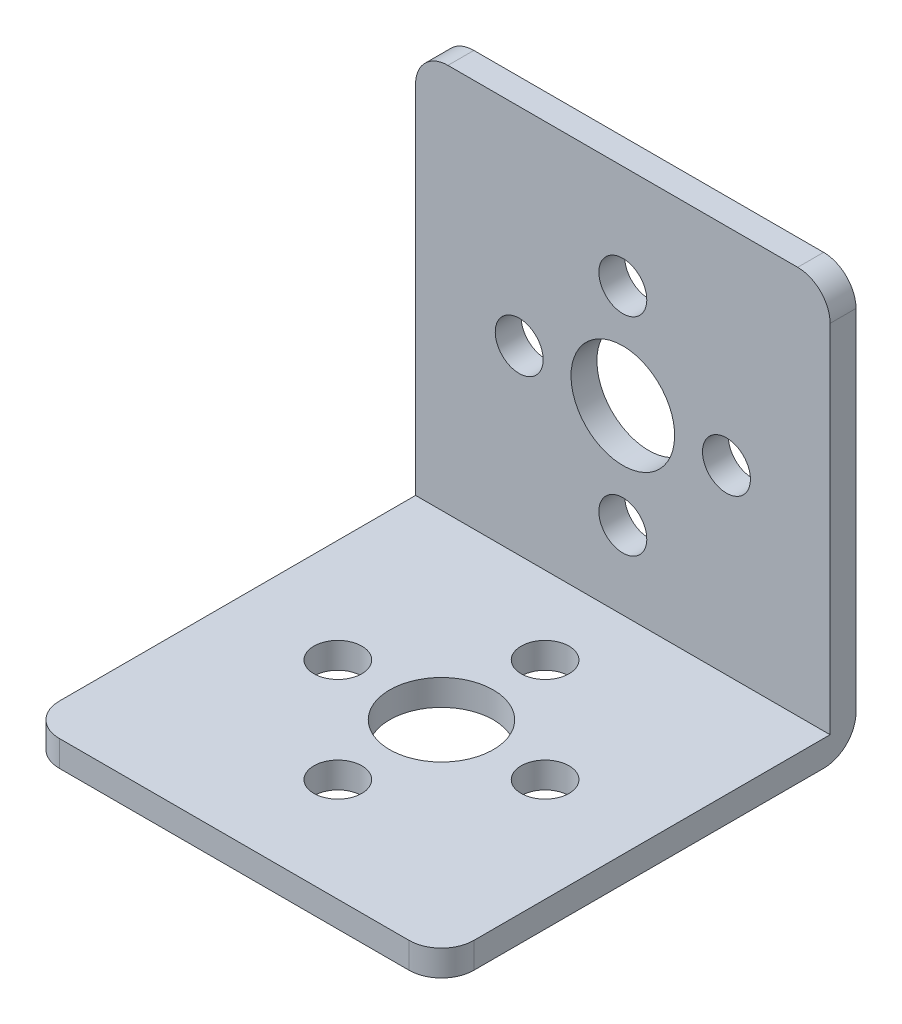
ISO-10303-21;
HEADER;
FILE_DESCRIPTION(('STEP AP214'),'2;1');
FILE_NAME('part.step','',(''),(''),'','','');
FILE_SCHEMA(('AUTOMOTIVE_DESIGN { 1 0 10303 214 1 1 1 1 }'));
ENDSEC;
DATA;
#1=APPLICATION_CONTEXT('core data for automotive mechanical design processes');
#2=APPLICATION_PROTOCOL_DEFINITION('international standard','automotive_design',2000,#1);
#3=PRODUCT_CONTEXT('',#1,'mechanical');
#4=PRODUCT('Part','Part','',(#3));
#5=PRODUCT_RELATED_PRODUCT_CATEGORY('part','',(#4));
#6=PRODUCT_DEFINITION_FORMATION('','',#4);
#7=PRODUCT_DEFINITION_CONTEXT('part definition',#1,'design');
#8=PRODUCT_DEFINITION('design','',#6,#7);
#9=PRODUCT_DEFINITION_SHAPE('','',#8);
#10=(LENGTH_UNIT() NAMED_UNIT(*) SI_UNIT(.MILLI.,.METRE.));
#11=(NAMED_UNIT(*) PLANE_ANGLE_UNIT() SI_UNIT($,.RADIAN.));
#12=(NAMED_UNIT(*) SI_UNIT($,.STERADIAN.) SOLID_ANGLE_UNIT());
#13=UNCERTAINTY_MEASURE_WITH_UNIT(LENGTH_MEASURE(1.E-05),#10,'distance_accuracy_value','');
#14=(GEOMETRIC_REPRESENTATION_CONTEXT(3) GLOBAL_UNCERTAINTY_ASSIGNED_CONTEXT((#13)) GLOBAL_UNIT_ASSIGNED_CONTEXT((#10,
#11,#12)) REPRESENTATION_CONTEXT('',''));
#15=CARTESIAN_POINT('',(0.,0.,0.));
#16=DIRECTION('',(0.,0.,1.));
#17=DIRECTION('',(1.,0.,0.));
#18=AXIS2_PLACEMENT_3D('',#15,#16,#17);
#19=CARTESIAN_POINT('',(16.,16.,-16.));
#20=DIRECTION('',(0.,0.,1.));
#21=DIRECTION('',(0.,-1.,0.));
#22=AXIS2_PLACEMENT_3D('',#19,#20,#21);
#23=PLANE('',#22);
#24=CARTESIAN_POINT('',(0.,-8.,-16.));
#25=DIRECTION('',(0.,0.,-1.));
#26=DIRECTION('',(0.,1.,0.));
#27=AXIS2_PLACEMENT_3D('',#24,#25,#26);
#28=CIRCLE('',#27,1.85);
#29=CARTESIAN_POINT('',(0.,-6.15,-16.));
#30=VERTEX_POINT('',#29);
#31=EDGE_CURVE('E184',#30,#30,#28,.T.);
#32=ORIENTED_EDGE('',*,*,#31,.F.);
#33=EDGE_LOOP('',(#32));
#34=FACE_BOUND('',#33,.T.);
#35=CARTESIAN_POINT('',(0.,8.,-16.));
#36=DIRECTION('',(0.,0.,-1.));
#37=DIRECTION('',(0.,1.,0.));
#38=AXIS2_PLACEMENT_3D('',#35,#36,#37);
#39=CIRCLE('',#38,1.85);
#40=CARTESIAN_POINT('',(0.,9.85,-16.));
#41=VERTEX_POINT('',#40);
#42=EDGE_CURVE('E180',#41,#41,#39,.T.);
#43=ORIENTED_EDGE('',*,*,#42,.F.);
#44=EDGE_LOOP('',(#43));
#45=FACE_BOUND('',#44,.T.);
#46=CARTESIAN_POINT('',(8.,0.,-16.));
#47=DIRECTION('',(0.,0.,-1.));
#48=DIRECTION('',(0.,1.,0.));
#49=AXIS2_PLACEMENT_3D('',#46,#47,#48);
#50=CIRCLE('',#49,1.85);
#51=CARTESIAN_POINT('',(8.,1.85,-16.));
#52=VERTEX_POINT('',#51);
#53=EDGE_CURVE('E176',#52,#52,#50,.T.);
#54=ORIENTED_EDGE('',*,*,#53,.F.);
#55=EDGE_LOOP('',(#54));
#56=FACE_BOUND('',#55,.T.);
#57=CARTESIAN_POINT('',(-8.,0.,-16.));
#58=DIRECTION('',(0.,0.,-1.));
#59=DIRECTION('',(0.,1.,0.));
#60=AXIS2_PLACEMENT_3D('',#57,#58,#59);
#61=CIRCLE('',#60,1.85);
#62=CARTESIAN_POINT('',(-8.,1.85,-16.));
#63=VERTEX_POINT('',#62);
#64=EDGE_CURVE('E172',#63,#63,#61,.T.);
#65=ORIENTED_EDGE('',*,*,#64,.F.);
#66=EDGE_LOOP('',(#65));
#67=FACE_BOUND('',#66,.T.);
#68=CARTESIAN_POINT('',(0.,0.,-16.));
#69=DIRECTION('',(0.,0.,-1.));
#70=DIRECTION('',(0.,1.,0.));
#71=AXIS2_PLACEMENT_3D('',#68,#69,#70);
#72=CIRCLE('',#71,4.);
#73=CARTESIAN_POINT('',(0.,4.,-16.));
#74=VERTEX_POINT('',#73);
#75=EDGE_CURVE('E168',#74,#74,#72,.T.);
#76=ORIENTED_EDGE('',*,*,#75,.F.);
#77=EDGE_LOOP('',(#76));
#78=FACE_BOUND('',#77,.T.);
#79=DIRECTION('',(0.,1.,0.));
#80=VECTOR('',#79,1.);
#81=CARTESIAN_POINT('',(16.,16.,-16.));
#82=LINE('',#81,#80);
#83=CARTESIAN_POINT('',(16.,-13.5,-16.));
#84=VERTEX_POINT('',#83);
#85=CARTESIAN_POINT('',(16.,13.5,-16.));
#86=VERTEX_POINT('',#85);
#87=EDGE_CURVE('E150',#84,#86,#82,.T.);
#88=ORIENTED_EDGE('',*,*,#87,.F.);
#89=DIRECTION('',(-1.,0.,0.));
#90=VECTOR('',#89,1.);
#91=CARTESIAN_POINT('',(16.,-13.5,-16.));
#92=LINE('',#91,#90);
#93=CARTESIAN_POINT('',(-16.,-13.5,-16.));
#94=VERTEX_POINT('',#93);
#95=EDGE_CURVE('E208',#84,#94,#92,.T.);
#96=ORIENTED_EDGE('',*,*,#95,.T.);
#97=DIRECTION('',(0.,1.,0.));
#98=VECTOR('',#97,1.);
#99=CARTESIAN_POINT('',(-16.,16.,-16.));
#100=LINE('',#99,#98);
#101=CARTESIAN_POINT('',(-16.,13.5,-16.));
#102=VERTEX_POINT('',#101);
#103=EDGE_CURVE('E147',#94,#102,#100,.T.);
#104=ORIENTED_EDGE('',*,*,#103,.T.);
#105=CARTESIAN_POINT('',(-13.5,13.5,-16.));
#106=DIRECTION('',(0.,0.,1.));
#107=DIRECTION('',(0.,-1.,0.));
#108=AXIS2_PLACEMENT_3D('',#105,#106,#107);
#109=CIRCLE('',#108,2.5);
#110=CARTESIAN_POINT('',(-13.5,16.,-16.));
#111=VERTEX_POINT('',#110);
#112=EDGE_CURVE('E206',#102,#111,#109,.F.);
#113=ORIENTED_EDGE('',*,*,#112,.T.);
#114=DIRECTION('',(-1.,0.,0.));
#115=VECTOR('',#114,1.);
#116=CARTESIAN_POINT('',(16.,16.,-16.));
#117=LINE('',#116,#115);
#118=CARTESIAN_POINT('',(13.5,16.,-16.));
#119=VERTEX_POINT('',#118);
#120=EDGE_CURVE('E162',#119,#111,#117,.T.);
#121=ORIENTED_EDGE('',*,*,#120,.F.);
#122=CARTESIAN_POINT('',(13.5,13.5,-16.));
#123=DIRECTION('',(0.,0.,1.));
#124=DIRECTION('',(0.,-1.,0.));
#125=AXIS2_PLACEMENT_3D('',#122,#123,#124);
#126=CIRCLE('',#125,2.5);
#127=EDGE_CURVE('E165',#119,#86,#126,.F.);
#128=ORIENTED_EDGE('',*,*,#127,.T.);
#129=EDGE_LOOP('',(#88,#96,#104,#113,#121,#128));
#130=FACE_BOUND('',#129,.T.);
#131=ADVANCED_FACE('F32',(#34,#45,#56,#67,#78,#130),#23,.F.);
#132=CARTESIAN_POINT('',(16.,16.,16.));
#133=DIRECTION('',(0.,-1.,0.));
#134=DIRECTION('',(0.,0.,-1.));
#135=AXIS2_PLACEMENT_3D('',#132,#133,#134);
#136=PLANE('',#135);
#137=ORIENTED_EDGE('',*,*,#120,.T.);
#138=DIRECTION('',(0.,0.,1.));
#139=VECTOR('',#138,1.);
#140=CARTESIAN_POINT('',(-13.5,16.,16.));
#141=LINE('',#140,#139);
#142=CARTESIAN_POINT('',(-13.5,16.,-14.));
#143=VERTEX_POINT('',#142);
#144=EDGE_CURVE('E238',#111,#143,#141,.T.);
#145=ORIENTED_EDGE('',*,*,#144,.T.);
#146=DIRECTION('',(1.,0.,0.));
#147=VECTOR('',#146,1.);
#148=CARTESIAN_POINT('',(-16.,16.,-14.));
#149=LINE('',#148,#147);
#150=CARTESIAN_POINT('',(13.5,16.,-14.));
#151=VERTEX_POINT('',#150);
#152=EDGE_CURVE('E133',#143,#151,#149,.T.);
#153=ORIENTED_EDGE('',*,*,#152,.T.);
#154=DIRECTION('',(0.,0.,1.));
#155=VECTOR('',#154,1.);
#156=CARTESIAN_POINT('',(13.5,16.,-16.));
#157=LINE('',#156,#155);
#158=EDGE_CURVE('E236',#151,#119,#157,.F.);
#159=ORIENTED_EDGE('',*,*,#158,.T.);
#160=EDGE_LOOP('',(#137,#145,#153,#159));
#161=FACE_BOUND('',#160,.T.);
#162=ADVANCED_FACE('F240',(#161),#136,.F.);
#163=CARTESIAN_POINT('',(16.,16.,16.));
#164=DIRECTION('',(0.,0.,-1.));
#165=DIRECTION('',(-1.,0.,0.));
#166=AXIS2_PLACEMENT_3D('',#163,#164,#165);
#167=PLANE('',#166);
#168=DIRECTION('',(1.,0.,0.));
#169=VECTOR('',#168,1.);
#170=CARTESIAN_POINT('',(-16.,-14.,16.));
#171=LINE('',#170,#169);
#172=CARTESIAN_POINT('',(-13.5,-14.,16.));
#173=VERTEX_POINT('',#172);
#174=CARTESIAN_POINT('',(13.5,-14.,16.));
#175=VERTEX_POINT('',#174);
#176=EDGE_CURVE('E134',#173,#175,#171,.T.);
#177=ORIENTED_EDGE('',*,*,#176,.F.);
#178=DIRECTION('',(0.,-1.,0.));
#179=VECTOR('',#178,1.);
#180=CARTESIAN_POINT('',(-13.5,16.,16.));
#181=LINE('',#180,#179);
#182=CARTESIAN_POINT('',(-13.5,-16.,16.));
#183=VERTEX_POINT('',#182);
#184=EDGE_CURVE('E230',#173,#183,#181,.T.);
#185=ORIENTED_EDGE('',*,*,#184,.T.);
#186=DIRECTION('',(-1.,0.,0.));
#187=VECTOR('',#186,1.);
#188=CARTESIAN_POINT('',(16.,-16.,16.));
#189=LINE('',#188,#187);
#190=CARTESIAN_POINT('',(13.5,-16.,16.));
#191=VERTEX_POINT('',#190);
#192=EDGE_CURVE('E155',#191,#183,#189,.T.);
#193=ORIENTED_EDGE('',*,*,#192,.F.);
#194=DIRECTION('',(0.,-1.,0.));
#195=VECTOR('',#194,1.);
#196=CARTESIAN_POINT('',(13.5,-14.,16.));
#197=LINE('',#196,#195);
#198=EDGE_CURVE('E228',#191,#175,#197,.F.);
#199=ORIENTED_EDGE('',*,*,#198,.T.);
#200=EDGE_LOOP('',(#177,#185,#193,#199));
#201=FACE_BOUND('',#200,.T.);
#202=ADVANCED_FACE('F273',(#201),#167,.F.);
#203=CARTESIAN_POINT('',(16.,-16.,16.));
#204=DIRECTION('',(0.,1.,0.));
#205=DIRECTION('',(0.,0.,1.));
#206=AXIS2_PLACEMENT_3D('',#203,#204,#205);
#207=PLANE('',#206);
#208=CARTESIAN_POINT('',(0.,-16.,-8.));
#209=DIRECTION('',(0.,-1.,0.));
#210=DIRECTION('',(0.,0.,-1.));
#211=AXIS2_PLACEMENT_3D('',#208,#209,#210);
#212=CIRCLE('',#211,1.85);
#213=CARTESIAN_POINT('',(0.,-16.,-9.85));
#214=VERTEX_POINT('',#213);
#215=EDGE_CURVE('E204',#214,#214,#212,.T.);
#216=ORIENTED_EDGE('',*,*,#215,.F.);
#217=EDGE_LOOP('',(#216));
#218=FACE_BOUND('',#217,.T.);
#219=CARTESIAN_POINT('',(0.,-16.,8.));
#220=DIRECTION('',(0.,-1.,0.));
#221=DIRECTION('',(0.,0.,-1.));
#222=AXIS2_PLACEMENT_3D('',#219,#220,#221);
#223=CIRCLE('',#222,1.85);
#224=CARTESIAN_POINT('',(0.,-16.,6.15));
#225=VERTEX_POINT('',#224);
#226=EDGE_CURVE('E200',#225,#225,#223,.T.);
#227=ORIENTED_EDGE('',*,*,#226,.F.);
#228=EDGE_LOOP('',(#227));
#229=FACE_BOUND('',#228,.T.);
#230=CARTESIAN_POINT('',(-8.,-16.,0.));
#231=DIRECTION('',(0.,-1.,0.));
#232=DIRECTION('',(0.,0.,-1.));
#233=AXIS2_PLACEMENT_3D('',#230,#231,#232);
#234=CIRCLE('',#233,1.85);
#235=CARTESIAN_POINT('',(-8.,-16.,-1.85));
#236=VERTEX_POINT('',#235);
#237=EDGE_CURVE('E196',#236,#236,#234,.T.);
#238=ORIENTED_EDGE('',*,*,#237,.F.);
#239=EDGE_LOOP('',(#238));
#240=FACE_BOUND('',#239,.T.);
#241=CARTESIAN_POINT('',(8.,-16.,0.));
#242=DIRECTION('',(0.,-1.,0.));
#243=DIRECTION('',(0.,0.,-1.));
#244=AXIS2_PLACEMENT_3D('',#241,#242,#243);
#245=CIRCLE('',#244,1.85);
#246=CARTESIAN_POINT('',(8.,-16.,-1.85));
#247=VERTEX_POINT('',#246);
#248=EDGE_CURVE('E192',#247,#247,#245,.T.);
#249=ORIENTED_EDGE('',*,*,#248,.F.);
#250=EDGE_LOOP('',(#249));
#251=FACE_BOUND('',#250,.T.);
#252=CARTESIAN_POINT('',(0.,-16.,0.));
#253=DIRECTION('',(0.,-1.,0.));
#254=DIRECTION('',(0.,0.,-1.));
#255=AXIS2_PLACEMENT_3D('',#252,#253,#254);
#256=CIRCLE('',#255,4.);
#257=CARTESIAN_POINT('',(0.,-16.,-4.));
#258=VERTEX_POINT('',#257);
#259=EDGE_CURVE('E188',#258,#258,#256,.T.);
#260=ORIENTED_EDGE('',*,*,#259,.F.);
#261=EDGE_LOOP('',(#260));
#262=FACE_BOUND('',#261,.T.);
#263=DIRECTION('',(0.,0.,-1.));
#264=VECTOR('',#263,1.);
#265=CARTESIAN_POINT('',(-16.,-16.,16.));
#266=LINE('',#265,#264);
#267=CARTESIAN_POINT('',(-16.,-16.,13.5));
#268=VERTEX_POINT('',#267);
#269=CARTESIAN_POINT('',(-16.,-16.,-13.5));
#270=VERTEX_POINT('',#269);
#271=EDGE_CURVE('E153',#268,#270,#266,.T.);
#272=ORIENTED_EDGE('',*,*,#271,.T.);
#273=DIRECTION('',(-1.,0.,0.));
#274=VECTOR('',#273,1.);
#275=CARTESIAN_POINT('',(16.,-16.,-13.5));
#276=LINE('',#275,#274);
#277=CARTESIAN_POINT('',(16.,-16.,-13.5));
#278=VERTEX_POINT('',#277);
#279=EDGE_CURVE('E221',#270,#278,#276,.F.);
#280=ORIENTED_EDGE('',*,*,#279,.T.);
#281=DIRECTION('',(0.,0.,-1.));
#282=VECTOR('',#281,1.);
#283=CARTESIAN_POINT('',(16.,-16.,16.));
#284=LINE('',#283,#282);
#285=CARTESIAN_POINT('',(16.,-16.,13.5));
#286=VERTEX_POINT('',#285);
#287=EDGE_CURVE('E152',#286,#278,#284,.T.);
#288=ORIENTED_EDGE('',*,*,#287,.F.);
#289=CARTESIAN_POINT('',(13.5,-16.,13.5));
#290=DIRECTION('',(0.,1.,0.));
#291=DIRECTION('',(0.,0.,1.));
#292=AXIS2_PLACEMENT_3D('',#289,#290,#291);
#293=CIRCLE('',#292,2.5);
#294=EDGE_CURVE('E217',#286,#191,#293,.F.);
#295=ORIENTED_EDGE('',*,*,#294,.T.);
#296=ORIENTED_EDGE('',*,*,#192,.T.);
#297=CARTESIAN_POINT('',(-13.5,-16.,13.5));
#298=DIRECTION('',(0.,1.,0.));
#299=DIRECTION('',(0.,0.,1.));
#300=AXIS2_PLACEMENT_3D('',#297,#298,#299);
#301=CIRCLE('',#300,2.5);
#302=EDGE_CURVE('E219',#183,#268,#301,.F.);
#303=ORIENTED_EDGE('',*,*,#302,.T.);
#304=EDGE_LOOP('',(#272,#280,#288,#295,#296,#303));
#305=FACE_BOUND('',#304,.T.);
#306=ADVANCED_FACE('F257',(#218,#229,#240,#251,#262,#305),#207,.F.);
#307=CARTESIAN_POINT('',(16.,-16.,-16.));
#308=DIRECTION('',(1.,0.,0.));
#309=DIRECTION('',(0.,0.,-1.));
#310=AXIS2_PLACEMENT_3D('',#307,#308,#309);
#311=PLANE('',#310);
#312=ORIENTED_EDGE('',*,*,#287,.T.);
#313=CARTESIAN_POINT('',(16.,-13.5,-13.5));
#314=DIRECTION('',(1.,0.,0.));
#315=DIRECTION('',(0.,0.,-1.));
#316=AXIS2_PLACEMENT_3D('',#313,#314,#315);
#317=CIRCLE('',#316,2.5);
#318=EDGE_CURVE('E226',#278,#84,#317,.T.);
#319=ORIENTED_EDGE('',*,*,#318,.T.);
#320=ORIENTED_EDGE('',*,*,#87,.T.);
#321=DIRECTION('',(0.,0.,1.));
#322=VECTOR('',#321,1.);
#323=CARTESIAN_POINT('',(16.,13.5,-14.));
#324=LINE('',#323,#322);
#325=CARTESIAN_POINT('',(16.,13.5,-14.));
#326=VERTEX_POINT('',#325);
#327=EDGE_CURVE('E141',#86,#326,#324,.T.);
#328=ORIENTED_EDGE('',*,*,#327,.T.);
#329=DIRECTION('',(0.,1.,0.));
#330=VECTOR('',#329,1.);
#331=CARTESIAN_POINT('',(16.,16.,-14.));
#332=LINE('',#331,#330);
#333=CARTESIAN_POINT('',(16.,-14.,-14.));
#334=VERTEX_POINT('',#333);
#335=EDGE_CURVE('E126',#334,#326,#332,.T.);
#336=ORIENTED_EDGE('',*,*,#335,.F.);
#337=DIRECTION('',(0.,0.,-1.));
#338=VECTOR('',#337,1.);
#339=CARTESIAN_POINT('',(16.,-14.,16.));
#340=LINE('',#339,#338);
#341=CARTESIAN_POINT('',(16.,-14.,13.5));
#342=VERTEX_POINT('',#341);
#343=EDGE_CURVE('E114',#342,#334,#340,.T.);
#344=ORIENTED_EDGE('',*,*,#343,.F.);
#345=DIRECTION('',(0.,-1.,0.));
#346=VECTOR('',#345,1.);
#347=CARTESIAN_POINT('',(16.,-16.,13.5));
#348=LINE('',#347,#346);
#349=EDGE_CURVE('E224',#342,#286,#348,.T.);
#350=ORIENTED_EDGE('',*,*,#349,.T.);
#351=EDGE_LOOP('',(#312,#319,#320,#328,#336,#344,#350));
#352=FACE_BOUND('',#351,.T.);
#353=ADVANCED_FACE('F138',(#352),#311,.T.);
#354=CARTESIAN_POINT('',(-16.,-16.,-16.));
#355=DIRECTION('',(1.,0.,0.));
#356=DIRECTION('',(0.,0.,-1.));
#357=AXIS2_PLACEMENT_3D('',#354,#355,#356);
#358=PLANE('',#357);
#359=ORIENTED_EDGE('',*,*,#103,.F.);
#360=CARTESIAN_POINT('',(-16.,-13.5,-13.5));
#361=DIRECTION('',(1.,0.,0.));
#362=DIRECTION('',(0.,0.,-1.));
#363=AXIS2_PLACEMENT_3D('',#360,#361,#362);
#364=CIRCLE('',#363,2.5);
#365=EDGE_CURVE('E215',#94,#270,#364,.F.);
#366=ORIENTED_EDGE('',*,*,#365,.T.);
#367=ORIENTED_EDGE('',*,*,#271,.F.);
#368=DIRECTION('',(0.,-1.,0.));
#369=VECTOR('',#368,1.);
#370=CARTESIAN_POINT('',(-16.,-16.,13.5));
#371=LINE('',#370,#369);
#372=CARTESIAN_POINT('',(-16.,-14.,13.5));
#373=VERTEX_POINT('',#372);
#374=EDGE_CURVE('E213',#268,#373,#371,.F.);
#375=ORIENTED_EDGE('',*,*,#374,.T.);
#376=DIRECTION('',(0.,0.,-1.));
#377=VECTOR('',#376,1.);
#378=CARTESIAN_POINT('',(-16.,-14.,16.));
#379=LINE('',#378,#377);
#380=CARTESIAN_POINT('',(-16.,-14.,-14.));
#381=VERTEX_POINT('',#380);
#382=EDGE_CURVE('E142',#373,#381,#379,.T.);
#383=ORIENTED_EDGE('',*,*,#382,.T.);
#384=DIRECTION('',(0.,1.,0.));
#385=VECTOR('',#384,1.);
#386=CARTESIAN_POINT('',(-16.,16.,-14.));
#387=LINE('',#386,#385);
#388=CARTESIAN_POINT('',(-16.,13.5,-14.));
#389=VERTEX_POINT('',#388);
#390=EDGE_CURVE('E132',#381,#389,#387,.T.);
#391=ORIENTED_EDGE('',*,*,#390,.T.);
#392=DIRECTION('',(0.,0.,1.));
#393=VECTOR('',#392,1.);
#394=CARTESIAN_POINT('',(-16.,13.5,-16.));
#395=LINE('',#394,#393);
#396=EDGE_CURVE('E211',#389,#102,#395,.F.);
#397=ORIENTED_EDGE('',*,*,#396,.T.);
#398=EDGE_LOOP('',(#359,#366,#367,#375,#383,#391,#397));
#399=FACE_BOUND('',#398,.T.);
#400=ADVANCED_FACE('F246',(#399),#358,.F.);
#401=CARTESIAN_POINT('',(-16.,16.,-14.));
#402=DIRECTION('',(0.,0.,-1.));
#403=DIRECTION('',(0.,1.,0.));
#404=AXIS2_PLACEMENT_3D('',#401,#402,#403);
#405=PLANE('',#404);
#406=CARTESIAN_POINT('',(0.,-8.,-14.));
#407=DIRECTION('',(0.,0.,-1.));
#408=DIRECTION('',(0.,1.,0.));
#409=AXIS2_PLACEMENT_3D('',#406,#407,#408);
#410=CIRCLE('',#409,1.85);
#411=CARTESIAN_POINT('',(0.,-6.15,-14.));
#412=VERTEX_POINT('',#411);
#413=EDGE_CURVE('E181',#412,#412,#410,.T.);
#414=ORIENTED_EDGE('',*,*,#413,.T.);
#415=EDGE_LOOP('',(#414));
#416=FACE_BOUND('',#415,.T.);
#417=CARTESIAN_POINT('',(0.,8.,-14.));
#418=DIRECTION('',(0.,0.,-1.));
#419=DIRECTION('',(0.,1.,0.));
#420=AXIS2_PLACEMENT_3D('',#417,#418,#419);
#421=CIRCLE('',#420,1.85);
#422=CARTESIAN_POINT('',(0.,9.85,-14.));
#423=VERTEX_POINT('',#422);
#424=EDGE_CURVE('E177',#423,#423,#421,.T.);
#425=ORIENTED_EDGE('',*,*,#424,.T.);
#426=EDGE_LOOP('',(#425));
#427=FACE_BOUND('',#426,.T.);
#428=CARTESIAN_POINT('',(8.,0.,-14.));
#429=DIRECTION('',(0.,0.,-1.));
#430=DIRECTION('',(0.,1.,0.));
#431=AXIS2_PLACEMENT_3D('',#428,#429,#430);
#432=CIRCLE('',#431,1.85);
#433=CARTESIAN_POINT('',(8.,1.85,-14.));
#434=VERTEX_POINT('',#433);
#435=EDGE_CURVE('E173',#434,#434,#432,.T.);
#436=ORIENTED_EDGE('',*,*,#435,.T.);
#437=EDGE_LOOP('',(#436));
#438=FACE_BOUND('',#437,.T.);
#439=CARTESIAN_POINT('',(-8.,0.,-14.));
#440=DIRECTION('',(0.,0.,-1.));
#441=DIRECTION('',(0.,1.,0.));
#442=AXIS2_PLACEMENT_3D('',#439,#440,#441);
#443=CIRCLE('',#442,1.85);
#444=CARTESIAN_POINT('',(-8.,1.85,-14.));
#445=VERTEX_POINT('',#444);
#446=EDGE_CURVE('E169',#445,#445,#443,.T.);
#447=ORIENTED_EDGE('',*,*,#446,.T.);
#448=EDGE_LOOP('',(#447));
#449=FACE_BOUND('',#448,.T.);
#450=CARTESIAN_POINT('',(0.,0.,-14.));
#451=DIRECTION('',(0.,0.,-1.));
#452=DIRECTION('',(0.,1.,0.));
#453=AXIS2_PLACEMENT_3D('',#450,#451,#452);
#454=CIRCLE('',#453,4.);
#455=CARTESIAN_POINT('',(0.,4.,-14.));
#456=VERTEX_POINT('',#455);
#457=EDGE_CURVE('E127',#456,#456,#454,.T.);
#458=ORIENTED_EDGE('',*,*,#457,.T.);
#459=EDGE_LOOP('',(#458));
#460=FACE_BOUND('',#459,.T.);
#461=ORIENTED_EDGE('',*,*,#152,.F.);
#462=CARTESIAN_POINT('',(-13.5,13.5,-14.));
#463=DIRECTION('',(0.,0.,-1.));
#464=DIRECTION('',(0.,1.,0.));
#465=AXIS2_PLACEMENT_3D('',#462,#463,#464);
#466=CIRCLE('',#465,2.5);
#467=EDGE_CURVE('E11',#143,#389,#466,.F.);
#468=ORIENTED_EDGE('',*,*,#467,.T.);
#469=ORIENTED_EDGE('',*,*,#390,.F.);
#470=DIRECTION('',(1.,0.,0.));
#471=VECTOR('',#470,1.);
#472=CARTESIAN_POINT('',(-16.,-14.,-14.));
#473=LINE('',#472,#471);
#474=EDGE_CURVE('E118',#381,#334,#473,.T.);
#475=ORIENTED_EDGE('',*,*,#474,.T.);
#476=ORIENTED_EDGE('',*,*,#335,.T.);
#477=CARTESIAN_POINT('',(13.5,13.5,-14.));
#478=DIRECTION('',(0.,0.,-1.));
#479=DIRECTION('',(0.,1.,0.));
#480=AXIS2_PLACEMENT_3D('',#477,#478,#479);
#481=CIRCLE('',#480,2.5);
#482=EDGE_CURVE('E40',#326,#151,#481,.F.);
#483=ORIENTED_EDGE('',*,*,#482,.T.);
#484=EDGE_LOOP('',(#461,#468,#469,#475,#476,#483));
#485=FACE_BOUND('',#484,.T.);
#486=ADVANCED_FACE('F130',(#416,#427,#438,#449,#460,#485),#405,.F.);
#487=CARTESIAN_POINT('',(-16.,-14.,16.));
#488=DIRECTION('',(0.,-1.,0.));
#489=DIRECTION('',(0.,0.,-1.));
#490=AXIS2_PLACEMENT_3D('',#487,#488,#489);
#491=PLANE('',#490);
#492=CARTESIAN_POINT('',(0.,-14.,-8.));
#493=DIRECTION('',(0.,-1.,0.));
#494=DIRECTION('',(0.,0.,-1.));
#495=AXIS2_PLACEMENT_3D('',#492,#493,#494);
#496=CIRCLE('',#495,1.85);
#497=CARTESIAN_POINT('',(0.,-14.,-9.85));
#498=VERTEX_POINT('',#497);
#499=EDGE_CURVE('E201',#498,#498,#496,.T.);
#500=ORIENTED_EDGE('',*,*,#499,.T.);
#501=EDGE_LOOP('',(#500));
#502=FACE_BOUND('',#501,.T.);
#503=CARTESIAN_POINT('',(0.,-14.,8.));
#504=DIRECTION('',(0.,-1.,0.));
#505=DIRECTION('',(0.,0.,-1.));
#506=AXIS2_PLACEMENT_3D('',#503,#504,#505);
#507=CIRCLE('',#506,1.85);
#508=CARTESIAN_POINT('',(0.,-14.,6.15));
#509=VERTEX_POINT('',#508);
#510=EDGE_CURVE('E197',#509,#509,#507,.T.);
#511=ORIENTED_EDGE('',*,*,#510,.T.);
#512=EDGE_LOOP('',(#511));
#513=FACE_BOUND('',#512,.T.);
#514=CARTESIAN_POINT('',(-8.,-14.,0.));
#515=DIRECTION('',(0.,-1.,0.));
#516=DIRECTION('',(0.,0.,-1.));
#517=AXIS2_PLACEMENT_3D('',#514,#515,#516);
#518=CIRCLE('',#517,1.85);
#519=CARTESIAN_POINT('',(-8.,-14.,-1.85));
#520=VERTEX_POINT('',#519);
#521=EDGE_CURVE('E193',#520,#520,#518,.T.);
#522=ORIENTED_EDGE('',*,*,#521,.T.);
#523=EDGE_LOOP('',(#522));
#524=FACE_BOUND('',#523,.T.);
#525=CARTESIAN_POINT('',(8.,-14.,0.));
#526=DIRECTION('',(0.,-1.,0.));
#527=DIRECTION('',(0.,0.,-1.));
#528=AXIS2_PLACEMENT_3D('',#525,#526,#527);
#529=CIRCLE('',#528,1.85);
#530=CARTESIAN_POINT('',(8.,-14.,-1.85));
#531=VERTEX_POINT('',#530);
#532=EDGE_CURVE('E189',#531,#531,#529,.T.);
#533=ORIENTED_EDGE('',*,*,#532,.T.);
#534=EDGE_LOOP('',(#533));
#535=FACE_BOUND('',#534,.T.);
#536=CARTESIAN_POINT('',(0.,-14.,0.));
#537=DIRECTION('',(0.,-1.,0.));
#538=DIRECTION('',(0.,0.,-1.));
#539=AXIS2_PLACEMENT_3D('',#536,#537,#538);
#540=CIRCLE('',#539,4.);
#541=CARTESIAN_POINT('',(0.,-14.,-4.));
#542=VERTEX_POINT('',#541);
#543=EDGE_CURVE('E185',#542,#542,#540,.T.);
#544=ORIENTED_EDGE('',*,*,#543,.T.);
#545=EDGE_LOOP('',(#544));
#546=FACE_BOUND('',#545,.T.);
#547=ORIENTED_EDGE('',*,*,#382,.F.);
#548=CARTESIAN_POINT('',(-13.5,-14.,13.5));
#549=DIRECTION('',(0.,-1.,0.));
#550=DIRECTION('',(0.,0.,-1.));
#551=AXIS2_PLACEMENT_3D('',#548,#549,#550);
#552=CIRCLE('',#551,2.5);
#553=EDGE_CURVE('E234',#373,#173,#552,.F.);
#554=ORIENTED_EDGE('',*,*,#553,.T.);
#555=ORIENTED_EDGE('',*,*,#176,.T.);
#556=CARTESIAN_POINT('',(13.5,-14.,13.5));
#557=DIRECTION('',(0.,-1.,0.));
#558=DIRECTION('',(0.,0.,-1.));
#559=AXIS2_PLACEMENT_3D('',#556,#557,#558);
#560=CIRCLE('',#559,2.5);
#561=EDGE_CURVE('E121',#175,#342,#560,.F.);
#562=ORIENTED_EDGE('',*,*,#561,.T.);
#563=ORIENTED_EDGE('',*,*,#343,.T.);
#564=ORIENTED_EDGE('',*,*,#474,.F.);
#565=EDGE_LOOP('',(#547,#554,#555,#562,#563,#564));
#566=FACE_BOUND('',#565,.T.);
#567=ADVANCED_FACE('F117',(#502,#513,#524,#535,#546,#566),#491,.F.);
#568=CARTESIAN_POINT('',(0.,0.,16.));
#569=DIRECTION('',(0.,0.,-1.));
#570=DIRECTION('',(0.,1.,0.));
#571=AXIS2_PLACEMENT_3D('',#568,#569,#570);
#572=CYLINDRICAL_SURFACE('',#571,4.);
#573=ORIENTED_EDGE('',*,*,#75,.T.);
#574=EDGE_LOOP('',(#573));
#575=FACE_BOUND('',#574,.T.);
#576=ORIENTED_EDGE('',*,*,#457,.F.);
#577=EDGE_LOOP('',(#576));
#578=FACE_BOUND('',#577,.T.);
#579=ADVANCED_FACE('F309',(#575,#578),#572,.F.);
#580=CARTESIAN_POINT('',(-8.,0.,16.));
#581=DIRECTION('',(0.,0.,-1.));
#582=DIRECTION('',(0.,1.,0.));
#583=AXIS2_PLACEMENT_3D('',#580,#581,#582);
#584=CYLINDRICAL_SURFACE('',#583,1.85);
#585=ORIENTED_EDGE('',*,*,#64,.T.);
#586=EDGE_LOOP('',(#585));
#587=FACE_BOUND('',#586,.T.);
#588=ORIENTED_EDGE('',*,*,#446,.F.);
#589=EDGE_LOOP('',(#588));
#590=FACE_BOUND('',#589,.T.);
#591=ADVANCED_FACE('F316',(#587,#590),#584,.F.);
#592=CARTESIAN_POINT('',(8.,0.,16.));
#593=DIRECTION('',(0.,0.,-1.));
#594=DIRECTION('',(0.,1.,0.));
#595=AXIS2_PLACEMENT_3D('',#592,#593,#594);
#596=CYLINDRICAL_SURFACE('',#595,1.85);
#597=ORIENTED_EDGE('',*,*,#53,.T.);
#598=EDGE_LOOP('',(#597));
#599=FACE_BOUND('',#598,.T.);
#600=ORIENTED_EDGE('',*,*,#435,.F.);
#601=EDGE_LOOP('',(#600));
#602=FACE_BOUND('',#601,.T.);
#603=ADVANCED_FACE('F320',(#599,#602),#596,.F.);
#604=CARTESIAN_POINT('',(0.,8.,16.));
#605=DIRECTION('',(0.,0.,-1.));
#606=DIRECTION('',(0.,1.,0.));
#607=AXIS2_PLACEMENT_3D('',#604,#605,#606);
#608=CYLINDRICAL_SURFACE('',#607,1.85);
#609=ORIENTED_EDGE('',*,*,#42,.T.);
#610=EDGE_LOOP('',(#609));
#611=FACE_BOUND('',#610,.T.);
#612=ORIENTED_EDGE('',*,*,#424,.F.);
#613=EDGE_LOOP('',(#612));
#614=FACE_BOUND('',#613,.T.);
#615=ADVANCED_FACE('F324',(#611,#614),#608,.F.);
#616=CARTESIAN_POINT('',(0.,-8.,16.));
#617=DIRECTION('',(0.,0.,-1.));
#618=DIRECTION('',(0.,1.,0.));
#619=AXIS2_PLACEMENT_3D('',#616,#617,#618);
#620=CYLINDRICAL_SURFACE('',#619,1.85);
#621=ORIENTED_EDGE('',*,*,#31,.T.);
#622=EDGE_LOOP('',(#621));
#623=FACE_BOUND('',#622,.T.);
#624=ORIENTED_EDGE('',*,*,#413,.F.);
#625=EDGE_LOOP('',(#624));
#626=FACE_BOUND('',#625,.T.);
#627=ADVANCED_FACE('F328',(#623,#626),#620,.F.);
#628=CARTESIAN_POINT('',(0.,16.,0.));
#629=DIRECTION('',(0.,-1.,0.));
#630=DIRECTION('',(0.,0.,-1.));
#631=AXIS2_PLACEMENT_3D('',#628,#629,#630);
#632=CYLINDRICAL_SURFACE('',#631,4.);
#633=ORIENTED_EDGE('',*,*,#259,.T.);
#634=EDGE_LOOP('',(#633));
#635=FACE_BOUND('',#634,.T.);
#636=ORIENTED_EDGE('',*,*,#543,.F.);
#637=EDGE_LOOP('',(#636));
#638=FACE_BOUND('',#637,.T.);
#639=ADVANCED_FACE('F332',(#635,#638),#632,.F.);
#640=CARTESIAN_POINT('',(8.,16.,0.));
#641=DIRECTION('',(0.,-1.,0.));
#642=DIRECTION('',(0.,0.,-1.));
#643=AXIS2_PLACEMENT_3D('',#640,#641,#642);
#644=CYLINDRICAL_SURFACE('',#643,1.85);
#645=ORIENTED_EDGE('',*,*,#248,.T.);
#646=EDGE_LOOP('',(#645));
#647=FACE_BOUND('',#646,.T.);
#648=ORIENTED_EDGE('',*,*,#532,.F.);
#649=EDGE_LOOP('',(#648));
#650=FACE_BOUND('',#649,.T.);
#651=ADVANCED_FACE('F336',(#647,#650),#644,.F.);
#652=CARTESIAN_POINT('',(-8.,16.,0.));
#653=DIRECTION('',(0.,-1.,0.));
#654=DIRECTION('',(0.,0.,-1.));
#655=AXIS2_PLACEMENT_3D('',#652,#653,#654);
#656=CYLINDRICAL_SURFACE('',#655,1.85);
#657=ORIENTED_EDGE('',*,*,#237,.T.);
#658=EDGE_LOOP('',(#657));
#659=FACE_BOUND('',#658,.T.);
#660=ORIENTED_EDGE('',*,*,#521,.F.);
#661=EDGE_LOOP('',(#660));
#662=FACE_BOUND('',#661,.T.);
#663=ADVANCED_FACE('F340',(#659,#662),#656,.F.);
#664=CARTESIAN_POINT('',(0.,16.,8.));
#665=DIRECTION('',(0.,-1.,0.));
#666=DIRECTION('',(0.,0.,-1.));
#667=AXIS2_PLACEMENT_3D('',#664,#665,#666);
#668=CYLINDRICAL_SURFACE('',#667,1.85);
#669=ORIENTED_EDGE('',*,*,#226,.T.);
#670=EDGE_LOOP('',(#669));
#671=FACE_BOUND('',#670,.T.);
#672=ORIENTED_EDGE('',*,*,#510,.F.);
#673=EDGE_LOOP('',(#672));
#674=FACE_BOUND('',#673,.T.);
#675=ADVANCED_FACE('F344',(#671,#674),#668,.F.);
#676=CARTESIAN_POINT('',(0.,16.,-8.));
#677=DIRECTION('',(0.,-1.,0.));
#678=DIRECTION('',(0.,0.,-1.));
#679=AXIS2_PLACEMENT_3D('',#676,#677,#678);
#680=CYLINDRICAL_SURFACE('',#679,1.85);
#681=ORIENTED_EDGE('',*,*,#215,.T.);
#682=EDGE_LOOP('',(#681));
#683=FACE_BOUND('',#682,.T.);
#684=ORIENTED_EDGE('',*,*,#499,.F.);
#685=EDGE_LOOP('',(#684));
#686=FACE_BOUND('',#685,.T.);
#687=ADVANCED_FACE('F282',(#683,#686),#680,.F.);
#688=CARTESIAN_POINT('',(16.,-13.5,-13.5));
#689=DIRECTION('',(-1.,0.,0.));
#690=DIRECTION('',(0.,0.,1.));
#691=AXIS2_PLACEMENT_3D('',#688,#689,#690);
#692=CYLINDRICAL_SURFACE('',#691,2.5);
#693=ORIENTED_EDGE('',*,*,#318,.F.);
#694=ORIENTED_EDGE('',*,*,#279,.F.);
#695=ORIENTED_EDGE('',*,*,#365,.F.);
#696=ORIENTED_EDGE('',*,*,#95,.F.);
#697=EDGE_LOOP('',(#693,#694,#695,#696));
#698=FACE_BOUND('',#697,.T.);
#699=ADVANCED_FACE('F260',(#698),#692,.T.);
#700=CARTESIAN_POINT('',(-13.5,16.,13.5));
#701=DIRECTION('',(0.,-1.,0.));
#702=DIRECTION('',(0.,0.,-1.));
#703=AXIS2_PLACEMENT_3D('',#700,#701,#702);
#704=CYLINDRICAL_SURFACE('',#703,2.5);
#705=ORIENTED_EDGE('',*,*,#553,.F.);
#706=ORIENTED_EDGE('',*,*,#374,.F.);
#707=ORIENTED_EDGE('',*,*,#302,.F.);
#708=ORIENTED_EDGE('',*,*,#184,.F.);
#709=EDGE_LOOP('',(#705,#706,#707,#708));
#710=FACE_BOUND('',#709,.T.);
#711=ADVANCED_FACE('F281',(#710),#704,.T.);
#712=CARTESIAN_POINT('',(13.5,-16.,13.5));
#713=DIRECTION('',(0.,1.,0.));
#714=DIRECTION('',(0.,0.,1.));
#715=AXIS2_PLACEMENT_3D('',#712,#713,#714);
#716=CYLINDRICAL_SURFACE('',#715,2.5);
#717=ORIENTED_EDGE('',*,*,#561,.F.);
#718=ORIENTED_EDGE('',*,*,#198,.F.);
#719=ORIENTED_EDGE('',*,*,#294,.F.);
#720=ORIENTED_EDGE('',*,*,#349,.F.);
#721=EDGE_LOOP('',(#717,#718,#719,#720));
#722=FACE_BOUND('',#721,.T.);
#723=ADVANCED_FACE('F266',(#722),#716,.T.);
#724=CARTESIAN_POINT('',(-13.5,13.5,16.));
#725=DIRECTION('',(0.,0.,1.));
#726=DIRECTION('',(1.,0.,0.));
#727=AXIS2_PLACEMENT_3D('',#724,#725,#726);
#728=CYLINDRICAL_SURFACE('',#727,2.5);
#729=ORIENTED_EDGE('',*,*,#112,.F.);
#730=ORIENTED_EDGE('',*,*,#396,.F.);
#731=ORIENTED_EDGE('',*,*,#467,.F.);
#732=ORIENTED_EDGE('',*,*,#144,.F.);
#733=EDGE_LOOP('',(#729,#730,#731,#732));
#734=FACE_BOUND('',#733,.T.);
#735=ADVANCED_FACE('F247',(#734),#728,.T.);
#736=CARTESIAN_POINT('',(13.5,13.5,-16.));
#737=DIRECTION('',(0.,0.,-1.));
#738=DIRECTION('',(-1.,0.,0.));
#739=AXIS2_PLACEMENT_3D('',#736,#737,#738);
#740=CYLINDRICAL_SURFACE('',#739,2.5);
#741=ORIENTED_EDGE('',*,*,#127,.F.);
#742=ORIENTED_EDGE('',*,*,#158,.F.);
#743=ORIENTED_EDGE('',*,*,#482,.F.);
#744=ORIENTED_EDGE('',*,*,#327,.F.);
#745=EDGE_LOOP('',(#741,#742,#743,#744));
#746=FACE_BOUND('',#745,.T.);
#747=ADVANCED_FACE('F34',(#746),#740,.T.);
#748=CLOSED_SHELL('',(#131,#162,#202,#306,#353,#400,#486,#567,#579,#591,#603,#615,#627,#639,
#651,#663,#675,#687,#699,#711,#723,#735,#747));
#749=MANIFOLD_SOLID_BREP('B2',#748);
#750=ADVANCED_BREP_SHAPE_REPRESENTATION('',(#18,#749),#14);
#751=SHAPE_DEFINITION_REPRESENTATION(#9,#750);
ENDSEC;
END-ISO-10303-21;
